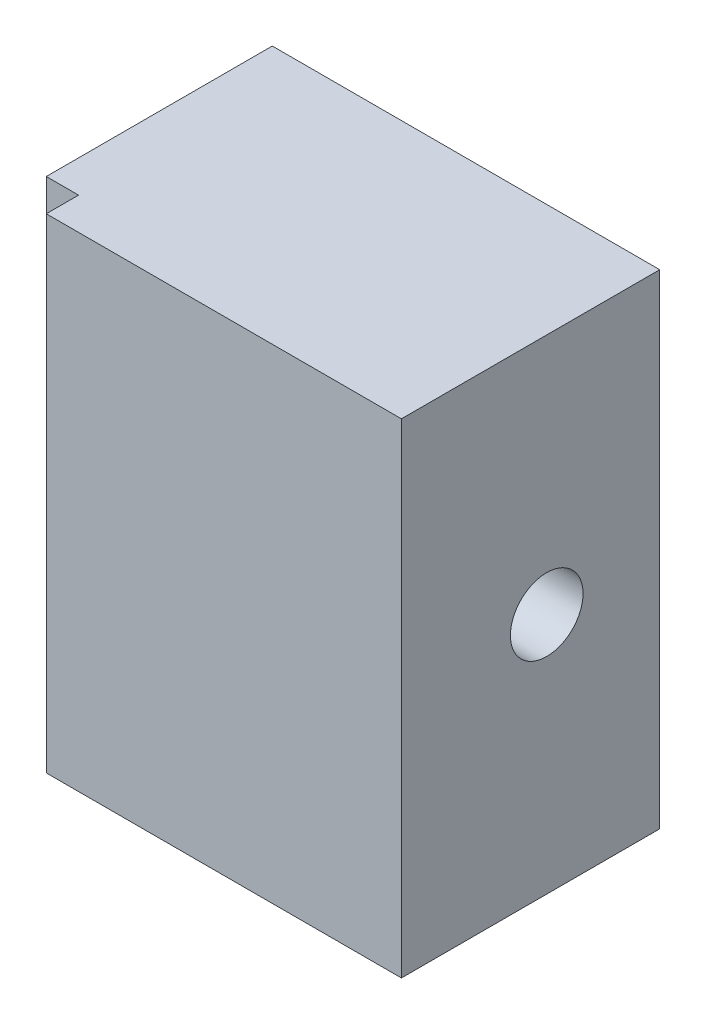
ISO-10303-21;
HEADER;
FILE_DESCRIPTION(('STEP AP214'),'2;1');
FILE_NAME('part.step','',(''),(''),'','','');
FILE_SCHEMA(('AUTOMOTIVE_DESIGN { 1 0 10303 214 1 1 1 1 }'));
ENDSEC;
DATA;
#1=APPLICATION_CONTEXT('core data for automotive mechanical design processes');
#2=APPLICATION_PROTOCOL_DEFINITION('international standard','automotive_design',2000,#1);
#3=PRODUCT_CONTEXT('',#1,'mechanical');
#4=PRODUCT('Part','Part','',(#3));
#5=PRODUCT_RELATED_PRODUCT_CATEGORY('part','',(#4));
#6=PRODUCT_DEFINITION_FORMATION('','',#4);
#7=PRODUCT_DEFINITION_CONTEXT('part definition',#1,'design');
#8=PRODUCT_DEFINITION('design','',#6,#7);
#9=PRODUCT_DEFINITION_SHAPE('','',#8);
#10=(LENGTH_UNIT() NAMED_UNIT(*) SI_UNIT(.MILLI.,.METRE.));
#11=(NAMED_UNIT(*) PLANE_ANGLE_UNIT() SI_UNIT($,.RADIAN.));
#12=(NAMED_UNIT(*) SI_UNIT($,.STERADIAN.) SOLID_ANGLE_UNIT());
#13=UNCERTAINTY_MEASURE_WITH_UNIT(LENGTH_MEASURE(1.E-05),#10,'distance_accuracy_value','');
#14=(GEOMETRIC_REPRESENTATION_CONTEXT(3) GLOBAL_UNCERTAINTY_ASSIGNED_CONTEXT((#13)) GLOBAL_UNIT_ASSIGNED_CONTEXT((#10,
#11,#12)) REPRESENTATION_CONTEXT('',''));
#15=CARTESIAN_POINT('',(0.,0.,0.));
#16=DIRECTION('',(0.,0.,1.));
#17=DIRECTION('',(1.,0.,0.));
#18=AXIS2_PLACEMENT_3D('',#15,#16,#17);
#19=CARTESIAN_POINT('',(24.,0.,0.));
#20=DIRECTION('',(0.,0.,1.));
#21=DIRECTION('',(1.,0.,0.));
#22=AXIS2_PLACEMENT_3D('',#19,#20,#21);
#23=PLANE('',#22);
#24=DIRECTION('',(0.,1.,0.));
#25=VECTOR('',#24,1.);
#26=CARTESIAN_POINT('',(0.,0.,0.));
#27=LINE('',#26,#25);
#28=CARTESIAN_POINT('',(0.,0.,0.));
#29=VERTEX_POINT('',#28);
#30=CARTESIAN_POINT('',(0.,30.,0.));
#31=VERTEX_POINT('',#30);
#32=EDGE_CURVE('E125',#29,#31,#27,.T.);
#33=ORIENTED_EDGE('',*,*,#32,.T.);
#34=DIRECTION('',(-1.,0.,0.));
#35=VECTOR('',#34,1.);
#36=CARTESIAN_POINT('',(24.,30.,0.));
#37=LINE('',#36,#35);
#38=CARTESIAN_POINT('',(24.,30.,0.));
#39=VERTEX_POINT('',#38);
#40=EDGE_CURVE('E11',#39,#31,#37,.T.);
#41=ORIENTED_EDGE('',*,*,#40,.F.);
#42=DIRECTION('',(0.,1.,0.));
#43=VECTOR('',#42,1.);
#44=CARTESIAN_POINT('',(24.,0.,0.));
#45=LINE('',#44,#43);
#46=CARTESIAN_POINT('',(24.,0.,0.));
#47=VERTEX_POINT('',#46);
#48=EDGE_CURVE('E122',#47,#39,#45,.T.);
#49=ORIENTED_EDGE('',*,*,#48,.F.);
#50=DIRECTION('',(-1.,0.,0.));
#51=VECTOR('',#50,1.);
#52=CARTESIAN_POINT('',(24.,0.,0.));
#53=LINE('',#52,#51);
#54=EDGE_CURVE('E117',#47,#29,#53,.T.);
#55=ORIENTED_EDGE('',*,*,#54,.T.);
#56=EDGE_LOOP('',(#33,#41,#49,#55));
#57=FACE_BOUND('',#56,.T.);
#58=ADVANCED_FACE('F35',(#57),#23,.F.);
#59=CARTESIAN_POINT('',(24.,30.,0.));
#60=DIRECTION('',(0.,-1.,0.));
#61=DIRECTION('',(0.,0.,-1.));
#62=AXIS2_PLACEMENT_3D('',#59,#60,#61);
#63=PLANE('',#62);
#64=DIRECTION('',(0.,0.,1.));
#65=VECTOR('',#64,1.);
#66=CARTESIAN_POINT('',(0.,30.,0.));
#67=LINE('',#66,#65);
#68=CARTESIAN_POINT('',(0.,30.,14.));
#69=VERTEX_POINT('',#68);
#70=EDGE_CURVE('E123',#31,#69,#67,.T.);
#71=ORIENTED_EDGE('',*,*,#70,.T.);
#72=DIRECTION('',(-1.,0.,0.));
#73=VECTOR('',#72,1.);
#74=CARTESIAN_POINT('',(2.,30.,14.));
#75=LINE('',#74,#73);
#76=CARTESIAN_POINT('',(2.,30.,14.));
#77=VERTEX_POINT('',#76);
#78=EDGE_CURVE('E49',#77,#69,#75,.T.);
#79=ORIENTED_EDGE('',*,*,#78,.F.);
#80=DIRECTION('',(0.,0.,-1.));
#81=VECTOR('',#80,1.);
#82=CARTESIAN_POINT('',(2.,30.,16.));
#83=LINE('',#82,#81);
#84=CARTESIAN_POINT('',(2.,30.,16.));
#85=VERTEX_POINT('',#84);
#86=EDGE_CURVE('E100',#85,#77,#83,.T.);
#87=ORIENTED_EDGE('',*,*,#86,.F.);
#88=DIRECTION('',(-1.,0.,0.));
#89=VECTOR('',#88,1.);
#90=CARTESIAN_POINT('',(24.,30.,16.));
#91=LINE('',#90,#89);
#92=CARTESIAN_POINT('',(24.,30.,16.));
#93=VERTEX_POINT('',#92);
#94=EDGE_CURVE('E42',#93,#85,#91,.T.);
#95=ORIENTED_EDGE('',*,*,#94,.F.);
#96=DIRECTION('',(0.,0.,1.));
#97=VECTOR('',#96,1.);
#98=CARTESIAN_POINT('',(24.,30.,0.));
#99=LINE('',#98,#97);
#100=EDGE_CURVE('E80',#39,#93,#99,.T.);
#101=ORIENTED_EDGE('',*,*,#100,.F.);
#102=ORIENTED_EDGE('',*,*,#40,.T.);
#103=EDGE_LOOP('',(#71,#79,#87,#95,#101,#102));
#104=FACE_BOUND('',#103,.T.);
#105=ADVANCED_FACE('F110',(#104),#63,.F.);
#106=CARTESIAN_POINT('',(24.,0.,16.));
#107=DIRECTION('',(0.,0.,-1.));
#108=DIRECTION('',(0.,1.,0.));
#109=AXIS2_PLACEMENT_3D('',#106,#107,#108);
#110=PLANE('',#109);
#111=ORIENTED_EDGE('',*,*,#94,.T.);
#112=DIRECTION('',(0.,1.,0.));
#113=VECTOR('',#112,1.);
#114=CARTESIAN_POINT('',(2.,30.,16.));
#115=LINE('',#114,#113);
#116=CARTESIAN_POINT('',(2.,0.,16.));
#117=VERTEX_POINT('',#116);
#118=EDGE_CURVE('E96',#117,#85,#115,.T.);
#119=ORIENTED_EDGE('',*,*,#118,.F.);
#120=DIRECTION('',(-1.,0.,0.));
#121=VECTOR('',#120,1.);
#122=CARTESIAN_POINT('',(24.,0.,16.));
#123=LINE('',#122,#121);
#124=CARTESIAN_POINT('',(24.,0.,16.));
#125=VERTEX_POINT('',#124);
#126=EDGE_CURVE('E116',#125,#117,#123,.T.);
#127=ORIENTED_EDGE('',*,*,#126,.F.);
#128=DIRECTION('',(0.,-1.,0.));
#129=VECTOR('',#128,1.);
#130=CARTESIAN_POINT('',(24.,0.,16.));
#131=LINE('',#130,#129);
#132=EDGE_CURVE('E115',#93,#125,#131,.T.);
#133=ORIENTED_EDGE('',*,*,#132,.F.);
#134=EDGE_LOOP('',(#111,#119,#127,#133));
#135=FACE_BOUND('',#134,.T.);
#136=ADVANCED_FACE('F114',(#135),#110,.F.);
#137=CARTESIAN_POINT('',(24.,0.,0.));
#138=DIRECTION('',(0.,1.,0.));
#139=DIRECTION('',(0.,0.,1.));
#140=AXIS2_PLACEMENT_3D('',#137,#138,#139);
#141=PLANE('',#140);
#142=DIRECTION('',(0.,0.,1.));
#143=VECTOR('',#142,1.);
#144=CARTESIAN_POINT('',(2.,0.,16.));
#145=LINE('',#144,#143);
#146=CARTESIAN_POINT('',(2.,0.,14.));
#147=VERTEX_POINT('',#146);
#148=EDGE_CURVE('E102',#147,#117,#145,.T.);
#149=ORIENTED_EDGE('',*,*,#148,.F.);
#150=DIRECTION('',(-1.,0.,0.));
#151=VECTOR('',#150,1.);
#152=CARTESIAN_POINT('',(2.,0.,14.));
#153=LINE('',#152,#151);
#154=CARTESIAN_POINT('',(0.,0.,14.));
#155=VERTEX_POINT('',#154);
#156=EDGE_CURVE('E128',#147,#155,#153,.T.);
#157=ORIENTED_EDGE('',*,*,#156,.T.);
#158=DIRECTION('',(0.,0.,-1.));
#159=VECTOR('',#158,1.);
#160=CARTESIAN_POINT('',(0.,0.,0.));
#161=LINE('',#160,#159);
#162=EDGE_CURVE('E73',#155,#29,#161,.T.);
#163=ORIENTED_EDGE('',*,*,#162,.T.);
#164=ORIENTED_EDGE('',*,*,#54,.F.);
#165=DIRECTION('',(0.,0.,-1.));
#166=VECTOR('',#165,1.);
#167=CARTESIAN_POINT('',(24.,0.,0.));
#168=LINE('',#167,#166);
#169=EDGE_CURVE('E58',#125,#47,#168,.T.);
#170=ORIENTED_EDGE('',*,*,#169,.F.);
#171=ORIENTED_EDGE('',*,*,#126,.T.);
#172=EDGE_LOOP('',(#149,#157,#163,#164,#170,#171));
#173=FACE_BOUND('',#172,.T.);
#174=ADVANCED_FACE('F150',(#173),#141,.F.);
#175=CARTESIAN_POINT('',(24.,0.,0.));
#176=DIRECTION('',(1.,0.,0.));
#177=DIRECTION('',(0.,0.,-1.));
#178=AXIS2_PLACEMENT_3D('',#175,#176,#177);
#179=PLANE('',#178);
#180=CARTESIAN_POINT('',(24.,15.,7.));
#181=DIRECTION('',(1.,0.,0.));
#182=DIRECTION('',(0.,0.,-1.));
#183=AXIS2_PLACEMENT_3D('',#180,#181,#182);
#184=CIRCLE('',#183,2.24999999999999);
#185=CARTESIAN_POINT('',(24.,15.,4.75000000000001));
#186=VERTEX_POINT('',#185);
#187=EDGE_CURVE('E141',#186,#186,#184,.T.);
#188=ORIENTED_EDGE('',*,*,#187,.F.);
#189=EDGE_LOOP('',(#188));
#190=FACE_BOUND('',#189,.T.);
#191=ORIENTED_EDGE('',*,*,#48,.T.);
#192=ORIENTED_EDGE('',*,*,#100,.T.);
#193=ORIENTED_EDGE('',*,*,#132,.T.);
#194=ORIENTED_EDGE('',*,*,#169,.T.);
#195=EDGE_LOOP('',(#191,#192,#193,#194));
#196=FACE_BOUND('',#195,.T.);
#197=ADVANCED_FACE('F147',(#190,#196),#179,.T.);
#198=CARTESIAN_POINT('',(0.,0.,0.));
#199=DIRECTION('',(1.,0.,0.));
#200=DIRECTION('',(0.,0.,-1.));
#201=AXIS2_PLACEMENT_3D('',#198,#199,#200);
#202=PLANE('',#201);
#203=CARTESIAN_POINT('',(0.,15.,7.));
#204=DIRECTION('',(1.,0.,0.));
#205=DIRECTION('',(0.,0.,-1.));
#206=AXIS2_PLACEMENT_3D('',#203,#204,#205);
#207=CIRCLE('',#206,2.25);
#208=CARTESIAN_POINT('',(0.,15.,4.75000000000001));
#209=VERTEX_POINT('',#208);
#210=EDGE_CURVE('E136',#209,#209,#207,.T.);
#211=ORIENTED_EDGE('',*,*,#210,.T.);
#212=EDGE_LOOP('',(#211));
#213=FACE_BOUND('',#212,.T.);
#214=ORIENTED_EDGE('',*,*,#162,.F.);
#215=DIRECTION('',(0.,-1.,0.));
#216=VECTOR('',#215,1.);
#217=CARTESIAN_POINT('',(0.,30.,14.));
#218=LINE('',#217,#216);
#219=EDGE_CURVE('E107',#69,#155,#218,.T.);
#220=ORIENTED_EDGE('',*,*,#219,.F.);
#221=ORIENTED_EDGE('',*,*,#70,.F.);
#222=ORIENTED_EDGE('',*,*,#32,.F.);
#223=EDGE_LOOP('',(#214,#220,#221,#222));
#224=FACE_BOUND('',#223,.T.);
#225=ADVANCED_FACE('F149',(#213,#224),#202,.F.);
#226=CARTESIAN_POINT('',(2.,30.,14.));
#227=DIRECTION('',(0.,0.,-1.));
#228=DIRECTION('',(0.,1.,0.));
#229=AXIS2_PLACEMENT_3D('',#226,#227,#228);
#230=PLANE('',#229);
#231=ORIENTED_EDGE('',*,*,#219,.T.);
#232=ORIENTED_EDGE('',*,*,#156,.F.);
#233=DIRECTION('',(0.,-1.,0.));
#234=VECTOR('',#233,1.);
#235=CARTESIAN_POINT('',(2.,30.,14.));
#236=LINE('',#235,#234);
#237=EDGE_CURVE('E112',#77,#147,#236,.T.);
#238=ORIENTED_EDGE('',*,*,#237,.F.);
#239=ORIENTED_EDGE('',*,*,#78,.T.);
#240=EDGE_LOOP('',(#231,#232,#238,#239));
#241=FACE_BOUND('',#240,.T.);
#242=ADVANCED_FACE('F157',(#241),#230,.F.);
#243=CARTESIAN_POINT('',(2.,0.,0.));
#244=DIRECTION('',(1.,0.,0.));
#245=DIRECTION('',(0.,0.,-1.));
#246=AXIS2_PLACEMENT_3D('',#243,#244,#245);
#247=PLANE('',#246);
#248=ORIENTED_EDGE('',*,*,#118,.T.);
#249=ORIENTED_EDGE('',*,*,#86,.T.);
#250=ORIENTED_EDGE('',*,*,#237,.T.);
#251=ORIENTED_EDGE('',*,*,#148,.T.);
#252=EDGE_LOOP('',(#248,#249,#250,#251));
#253=FACE_BOUND('',#252,.T.);
#254=ADVANCED_FACE('F98',(#253),#247,.F.);
#255=CARTESIAN_POINT('',(24.,15.,7.));
#256=DIRECTION('',(1.,0.,0.));
#257=DIRECTION('',(0.,0.,-1.));
#258=AXIS2_PLACEMENT_3D('',#255,#256,#257);
#259=CYLINDRICAL_SURFACE('',#258,2.24999999999999);
#260=ORIENTED_EDGE('',*,*,#210,.F.);
#261=EDGE_LOOP('',(#260));
#262=FACE_BOUND('',#261,.T.);
#263=ORIENTED_EDGE('',*,*,#187,.T.);
#264=EDGE_LOOP('',(#263));
#265=FACE_BOUND('',#264,.T.);
#266=ADVANCED_FACE('F145',(#262,#265),#259,.F.);
#267=CLOSED_SHELL('',(#58,#105,#136,#174,#197,#225,#242,#254,#266));
#268=MANIFOLD_SOLID_BREP('B2',#267);
#269=ADVANCED_BREP_SHAPE_REPRESENTATION('',(#18,#268),#14);
#270=SHAPE_DEFINITION_REPRESENTATION(#9,#269);
ENDSEC;
END-ISO-10303-21;
